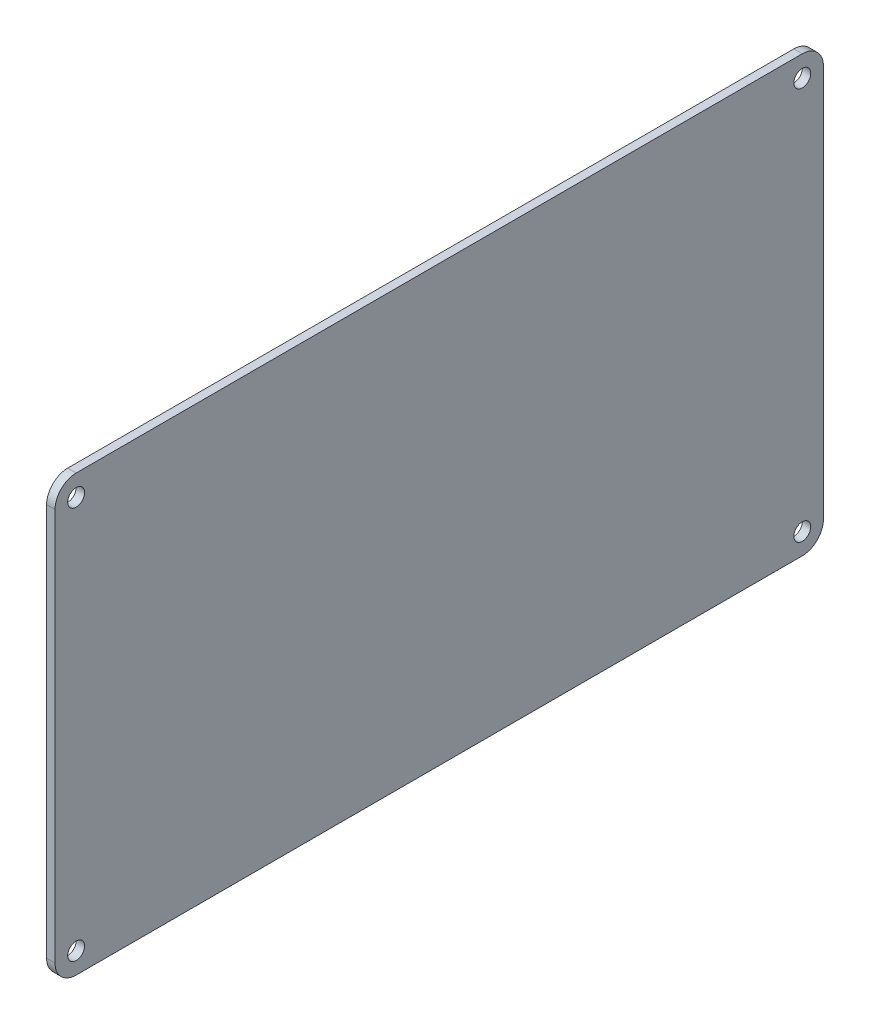
ISO-10303-21;
HEADER;
FILE_DESCRIPTION(('STEP AP214'),'2;1');
FILE_NAME('part.step','',(''),(''),'','','');
FILE_SCHEMA(('AUTOMOTIVE_DESIGN { 1 0 10303 214 1 1 1 1 }'));
ENDSEC;
DATA;
#1=APPLICATION_CONTEXT('core data for automotive mechanical design processes');
#2=APPLICATION_PROTOCOL_DEFINITION('international standard','automotive_design',2000,#1);
#3=PRODUCT_CONTEXT('',#1,'mechanical');
#4=PRODUCT('Part','Part','',(#3));
#5=PRODUCT_RELATED_PRODUCT_CATEGORY('part','',(#4));
#6=PRODUCT_DEFINITION_FORMATION('','',#4);
#7=PRODUCT_DEFINITION_CONTEXT('part definition',#1,'design');
#8=PRODUCT_DEFINITION('design','',#6,#7);
#9=PRODUCT_DEFINITION_SHAPE('','',#8);
#10=(LENGTH_UNIT() NAMED_UNIT(*) SI_UNIT(.MILLI.,.METRE.));
#11=(NAMED_UNIT(*) PLANE_ANGLE_UNIT() SI_UNIT($,.RADIAN.));
#12=(NAMED_UNIT(*) SI_UNIT($,.STERADIAN.) SOLID_ANGLE_UNIT());
#13=UNCERTAINTY_MEASURE_WITH_UNIT(LENGTH_MEASURE(1.E-05),#10,'distance_accuracy_value','');
#14=(GEOMETRIC_REPRESENTATION_CONTEXT(3) GLOBAL_UNCERTAINTY_ASSIGNED_CONTEXT((#13)) GLOBAL_UNIT_ASSIGNED_CONTEXT((#10,
#11,#12)) REPRESENTATION_CONTEXT('',''));
#15=CARTESIAN_POINT('',(0.,0.,0.));
#16=DIRECTION('',(0.,0.,1.));
#17=DIRECTION('',(1.,0.,0.));
#18=AXIS2_PLACEMENT_3D('',#15,#16,#17);
#19=CARTESIAN_POINT('',(0.,-3.82758620689654,5.));
#20=DIRECTION('',(-1.,0.,0.));
#21=DIRECTION('',(0.,0.,1.));
#22=AXIS2_PLACEMENT_3D('',#19,#20,#21);
#23=CYLINDRICAL_SURFACE('',#22,5.);
#24=DIRECTION('',(1.,0.,0.));
#25=VECTOR('',#24,1.);
#26=CARTESIAN_POINT('',(0.,-8.82758620689654,5.));
#27=LINE('',#26,#25);
#28=CARTESIAN_POINT('',(-2.,-8.82758620689654,5.));
#29=VERTEX_POINT('',#28);
#30=CARTESIAN_POINT('',(0.,-8.82758620689654,5.));
#31=VERTEX_POINT('',#30);
#32=EDGE_CURVE('E130',#29,#31,#27,.T.);
#33=ORIENTED_EDGE('',*,*,#32,.F.);
#34=CARTESIAN_POINT('',(-2.,-3.82758620689654,5.));
#35=DIRECTION('',(1.,0.,0.));
#36=DIRECTION('',(0.,0.,-1.));
#37=AXIS2_PLACEMENT_3D('',#34,#35,#36);
#38=CIRCLE('',#37,5.);
#39=CARTESIAN_POINT('',(-2.,-3.82758620689654,0.));
#40=VERTEX_POINT('',#39);
#41=EDGE_CURVE('E53',#40,#29,#38,.F.);
#42=ORIENTED_EDGE('',*,*,#41,.F.);
#43=DIRECTION('',(1.,0.,0.));
#44=VECTOR('',#43,1.);
#45=CARTESIAN_POINT('',(0.,-3.82758620689654,0.));
#46=LINE('',#45,#44);
#47=CARTESIAN_POINT('',(0.,-3.82758620689654,0.));
#48=VERTEX_POINT('',#47);
#49=EDGE_CURVE('E192',#48,#40,#46,.F.);
#50=ORIENTED_EDGE('',*,*,#49,.F.);
#51=CARTESIAN_POINT('',(0.,-3.82758620689654,5.));
#52=DIRECTION('',(-1.,0.,0.));
#53=DIRECTION('',(0.,0.,1.));
#54=AXIS2_PLACEMENT_3D('',#51,#52,#53);
#55=CIRCLE('',#54,5.);
#56=EDGE_CURVE('E11',#31,#48,#55,.F.);
#57=ORIENTED_EDGE('',*,*,#56,.F.);
#58=EDGE_LOOP('',(#33,#42,#50,#57));
#59=FACE_BOUND('',#58,.T.);
#60=ADVANCED_FACE('F45',(#59),#23,.T.);
#61=CARTESIAN_POINT('',(0.,89.1724137931034,5.));
#62=DIRECTION('',(1.,0.,0.));
#63=DIRECTION('',(0.,0.,-1.));
#64=AXIS2_PLACEMENT_3D('',#61,#62,#63);
#65=CYLINDRICAL_SURFACE('',#64,5.);
#66=DIRECTION('',(-1.,0.,0.));
#67=VECTOR('',#66,1.);
#68=CARTESIAN_POINT('',(0.,94.1724137931035,5.));
#69=LINE('',#68,#67);
#70=CARTESIAN_POINT('',(0.,94.1724137931035,5.));
#71=VERTEX_POINT('',#70);
#72=CARTESIAN_POINT('',(-2.,94.1724137931035,5.));
#73=VERTEX_POINT('',#72);
#74=EDGE_CURVE('E176',#71,#73,#69,.T.);
#75=ORIENTED_EDGE('',*,*,#74,.F.);
#76=CARTESIAN_POINT('',(0.,89.1724137931034,5.));
#77=DIRECTION('',(-1.,0.,0.));
#78=DIRECTION('',(0.,0.,1.));
#79=AXIS2_PLACEMENT_3D('',#76,#77,#78);
#80=CIRCLE('',#79,5.);
#81=CARTESIAN_POINT('',(0.,89.1724137931035,0.));
#82=VERTEX_POINT('',#81);
#83=EDGE_CURVE('E184',#82,#71,#80,.F.);
#84=ORIENTED_EDGE('',*,*,#83,.F.);
#85=DIRECTION('',(-1.,0.,0.));
#86=VECTOR('',#85,1.);
#87=CARTESIAN_POINT('',(0.,89.1724137931034,0.));
#88=LINE('',#87,#86);
#89=CARTESIAN_POINT('',(-2.,89.1724137931034,0.));
#90=VERTEX_POINT('',#89);
#91=EDGE_CURVE('E180',#90,#82,#88,.F.);
#92=ORIENTED_EDGE('',*,*,#91,.F.);
#93=CARTESIAN_POINT('',(-2.,89.1724137931034,5.));
#94=DIRECTION('',(1.,0.,0.));
#95=DIRECTION('',(0.,0.,-1.));
#96=AXIS2_PLACEMENT_3D('',#93,#94,#95);
#97=CIRCLE('',#96,5.);
#98=EDGE_CURVE('E187',#73,#90,#97,.F.);
#99=ORIENTED_EDGE('',*,*,#98,.F.);
#100=EDGE_LOOP('',(#75,#84,#92,#99));
#101=FACE_BOUND('',#100,.T.);
#102=ADVANCED_FACE('F264',(#101),#65,.T.);
#103=CARTESIAN_POINT('',(0.,89.1724137931034,177.));
#104=DIRECTION('',(1.,0.,0.));
#105=DIRECTION('',(0.,0.,-1.));
#106=AXIS2_PLACEMENT_3D('',#103,#104,#105);
#107=CYLINDRICAL_SURFACE('',#106,5.);
#108=DIRECTION('',(1.,0.,0.));
#109=VECTOR('',#108,1.);
#110=CARTESIAN_POINT('',(0.,94.1724137931035,177.));
#111=LINE('',#110,#109);
#112=CARTESIAN_POINT('',(-2.,94.1724137931035,177.));
#113=VERTEX_POINT('',#112);
#114=CARTESIAN_POINT('',(0.,94.1724137931035,177.));
#115=VERTEX_POINT('',#114);
#116=EDGE_CURVE('E162',#113,#115,#111,.T.);
#117=ORIENTED_EDGE('',*,*,#116,.F.);
#118=CARTESIAN_POINT('',(-2.,89.1724137931034,177.));
#119=DIRECTION('',(1.,0.,0.));
#120=DIRECTION('',(0.,0.,-1.));
#121=AXIS2_PLACEMENT_3D('',#118,#119,#120);
#122=CIRCLE('',#121,5.);
#123=CARTESIAN_POINT('',(-2.,89.1724137931034,182.));
#124=VERTEX_POINT('',#123);
#125=EDGE_CURVE('E170',#124,#113,#122,.F.);
#126=ORIENTED_EDGE('',*,*,#125,.F.);
#127=DIRECTION('',(1.,0.,0.));
#128=VECTOR('',#127,1.);
#129=CARTESIAN_POINT('',(0.,89.1724137931034,182.));
#130=LINE('',#129,#128);
#131=CARTESIAN_POINT('',(0.,89.1724137931035,182.));
#132=VERTEX_POINT('',#131);
#133=EDGE_CURVE('E166',#132,#124,#130,.F.);
#134=ORIENTED_EDGE('',*,*,#133,.F.);
#135=CARTESIAN_POINT('',(0.,89.1724137931034,177.));
#136=DIRECTION('',(-1.,0.,0.));
#137=DIRECTION('',(0.,0.,1.));
#138=AXIS2_PLACEMENT_3D('',#135,#136,#137);
#139=CIRCLE('',#138,5.);
#140=EDGE_CURVE('E173',#115,#132,#139,.F.);
#141=ORIENTED_EDGE('',*,*,#140,.F.);
#142=EDGE_LOOP('',(#117,#126,#134,#141));
#143=FACE_BOUND('',#142,.T.);
#144=ADVANCED_FACE('F269',(#143),#107,.T.);
#145=CARTESIAN_POINT('',(0.,-3.82758620689654,177.));
#146=DIRECTION('',(-1.,0.,0.));
#147=DIRECTION('',(0.,0.,1.));
#148=AXIS2_PLACEMENT_3D('',#145,#146,#147);
#149=CYLINDRICAL_SURFACE('',#148,5.);
#150=DIRECTION('',(-1.,0.,0.));
#151=VECTOR('',#150,1.);
#152=CARTESIAN_POINT('',(0.,-8.82758620689654,177.));
#153=LINE('',#152,#151);
#154=CARTESIAN_POINT('',(0.,-8.82758620689654,177.));
#155=VERTEX_POINT('',#154);
#156=CARTESIAN_POINT('',(-2.,-8.82758620689654,177.));
#157=VERTEX_POINT('',#156);
#158=EDGE_CURVE('E120',#155,#157,#153,.T.);
#159=ORIENTED_EDGE('',*,*,#158,.F.);
#160=CARTESIAN_POINT('',(0.,-3.82758620689654,177.));
#161=DIRECTION('',(-1.,0.,0.));
#162=DIRECTION('',(0.,0.,1.));
#163=AXIS2_PLACEMENT_3D('',#160,#161,#162);
#164=CIRCLE('',#163,5.);
#165=CARTESIAN_POINT('',(0.,-3.82758620689654,182.));
#166=VERTEX_POINT('',#165);
#167=EDGE_CURVE('E105',#166,#155,#164,.F.);
#168=ORIENTED_EDGE('',*,*,#167,.F.);
#169=DIRECTION('',(-1.,0.,0.));
#170=VECTOR('',#169,1.);
#171=CARTESIAN_POINT('',(0.,-3.82758620689654,182.));
#172=LINE('',#171,#170);
#173=CARTESIAN_POINT('',(-2.,-3.82758620689654,182.));
#174=VERTEX_POINT('',#173);
#175=EDGE_CURVE('E117',#174,#166,#172,.F.);
#176=ORIENTED_EDGE('',*,*,#175,.F.);
#177=CARTESIAN_POINT('',(-2.,-3.82758620689654,177.));
#178=DIRECTION('',(1.,0.,0.));
#179=DIRECTION('',(0.,0.,-1.));
#180=AXIS2_PLACEMENT_3D('',#177,#178,#179);
#181=CIRCLE('',#180,5.);
#182=EDGE_CURVE('E116',#157,#174,#181,.F.);
#183=ORIENTED_EDGE('',*,*,#182,.F.);
#184=EDGE_LOOP('',(#159,#168,#176,#183));
#185=FACE_BOUND('',#184,.T.);
#186=ADVANCED_FACE('F121',(#185),#149,.T.);
#187=CARTESIAN_POINT('',(0.,-8.82758620689654,182.));
#188=DIRECTION('',(0.,1.,0.));
#189=DIRECTION('',(0.,0.,1.));
#190=AXIS2_PLACEMENT_3D('',#187,#188,#189);
#191=PLANE('',#190);
#192=DIRECTION('',(0.,0.,-1.));
#193=VECTOR('',#192,1.);
#194=CARTESIAN_POINT('',(-2.,-8.82758620689654,182.));
#195=LINE('',#194,#193);
#196=EDGE_CURVE('E198',#157,#29,#195,.T.);
#197=ORIENTED_EDGE('',*,*,#196,.T.);
#198=ORIENTED_EDGE('',*,*,#32,.T.);
#199=DIRECTION('',(0.,0.,-1.));
#200=VECTOR('',#199,1.);
#201=CARTESIAN_POINT('',(0.,-8.82758620689654,182.));
#202=LINE('',#201,#200);
#203=EDGE_CURVE('E109',#155,#31,#202,.T.);
#204=ORIENTED_EDGE('',*,*,#203,.F.);
#205=ORIENTED_EDGE('',*,*,#158,.T.);
#206=EDGE_LOOP('',(#197,#198,#204,#205));
#207=FACE_BOUND('',#206,.T.);
#208=ADVANCED_FACE('F129',(#207),#191,.F.);
#209=CARTESIAN_POINT('',(0.,-8.82758620689654,182.));
#210=DIRECTION('',(-1.,0.,0.));
#211=DIRECTION('',(0.,0.,1.));
#212=AXIS2_PLACEMENT_3D('',#209,#210,#211);
#213=PLANE('',#212);
#214=CARTESIAN_POINT('',(0.,-3.82758620689654,5.));
#215=DIRECTION('',(1.,0.,0.));
#216=DIRECTION('',(0.,0.,-1.));
#217=AXIS2_PLACEMENT_3D('',#214,#215,#216);
#218=CIRCLE('',#217,2.);
#219=CARTESIAN_POINT('',(0.,-3.82758620689654,3.));
#220=VERTEX_POINT('',#219);
#221=EDGE_CURVE('E219',#220,#220,#218,.T.);
#222=ORIENTED_EDGE('',*,*,#221,.F.);
#223=EDGE_LOOP('',(#222));
#224=FACE_BOUND('',#223,.T.);
#225=CARTESIAN_POINT('',(0.,89.1724137931034,5.));
#226=DIRECTION('',(1.,0.,0.));
#227=DIRECTION('',(0.,0.,-1.));
#228=AXIS2_PLACEMENT_3D('',#225,#226,#227);
#229=CIRCLE('',#228,2.);
#230=CARTESIAN_POINT('',(0.,89.1724137931034,3.));
#231=VERTEX_POINT('',#230);
#232=EDGE_CURVE('E223',#231,#231,#229,.T.);
#233=ORIENTED_EDGE('',*,*,#232,.F.);
#234=EDGE_LOOP('',(#233));
#235=FACE_BOUND('',#234,.T.);
#236=CARTESIAN_POINT('',(0.,89.1724137931034,177.));
#237=DIRECTION('',(1.,0.,0.));
#238=DIRECTION('',(0.,0.,-1.));
#239=AXIS2_PLACEMENT_3D('',#236,#237,#238);
#240=CIRCLE('',#239,2.);
#241=CARTESIAN_POINT('',(0.,89.1724137931034,175.));
#242=VERTEX_POINT('',#241);
#243=EDGE_CURVE('E218',#242,#242,#240,.T.);
#244=ORIENTED_EDGE('',*,*,#243,.F.);
#245=EDGE_LOOP('',(#244));
#246=FACE_BOUND('',#245,.T.);
#247=CARTESIAN_POINT('',(0.,-3.82758620689654,177.));
#248=DIRECTION('',(1.,0.,0.));
#249=DIRECTION('',(0.,0.,-1.));
#250=AXIS2_PLACEMENT_3D('',#247,#248,#249);
#251=CIRCLE('',#250,2.);
#252=CARTESIAN_POINT('',(0.,-3.82758620689654,175.));
#253=VERTEX_POINT('',#252);
#254=EDGE_CURVE('E145',#253,#253,#251,.T.);
#255=ORIENTED_EDGE('',*,*,#254,.F.);
#256=EDGE_LOOP('',(#255));
#257=FACE_BOUND('',#256,.T.);
#258=ORIENTED_EDGE('',*,*,#203,.T.);
#259=ORIENTED_EDGE('',*,*,#56,.T.);
#260=DIRECTION('',(0.,1.,0.));
#261=VECTOR('',#260,1.);
#262=CARTESIAN_POINT('',(0.,-8.82758620689654,0.));
#263=LINE('',#262,#261);
#264=EDGE_CURVE('E156',#48,#82,#263,.T.);
#265=ORIENTED_EDGE('',*,*,#264,.T.);
#266=ORIENTED_EDGE('',*,*,#83,.T.);
#267=DIRECTION('',(0.,0.,-1.));
#268=VECTOR('',#267,1.);
#269=CARTESIAN_POINT('',(0.,94.1724137931035,182.));
#270=LINE('',#269,#268);
#271=EDGE_CURVE('E132',#115,#71,#270,.T.);
#272=ORIENTED_EDGE('',*,*,#271,.F.);
#273=ORIENTED_EDGE('',*,*,#140,.T.);
#274=DIRECTION('',(0.,1.,0.));
#275=VECTOR('',#274,1.);
#276=CARTESIAN_POINT('',(0.,-8.82758620689654,182.));
#277=LINE('',#276,#275);
#278=EDGE_CURVE('E111',#166,#132,#277,.T.);
#279=ORIENTED_EDGE('',*,*,#278,.F.);
#280=ORIENTED_EDGE('',*,*,#167,.T.);
#281=EDGE_LOOP('',(#258,#259,#265,#266,#272,#273,#279,#280));
#282=FACE_BOUND('',#281,.T.);
#283=ADVANCED_FACE('F107',(#224,#235,#246,#257,#282),#213,.F.);
#284=CARTESIAN_POINT('',(0.,94.1724137931035,182.));
#285=DIRECTION('',(0.,-1.,0.));
#286=DIRECTION('',(0.,0.,-1.));
#287=AXIS2_PLACEMENT_3D('',#284,#285,#286);
#288=PLANE('',#287);
#289=ORIENTED_EDGE('',*,*,#271,.T.);
#290=ORIENTED_EDGE('',*,*,#74,.T.);
#291=DIRECTION('',(0.,0.,-1.));
#292=VECTOR('',#291,1.);
#293=CARTESIAN_POINT('',(-2.,94.1724137931035,182.));
#294=LINE('',#293,#292);
#295=EDGE_CURVE('E136',#113,#73,#294,.T.);
#296=ORIENTED_EDGE('',*,*,#295,.F.);
#297=ORIENTED_EDGE('',*,*,#116,.T.);
#298=EDGE_LOOP('',(#289,#290,#296,#297));
#299=FACE_BOUND('',#298,.T.);
#300=ADVANCED_FACE('F236',(#299),#288,.F.);
#301=CARTESIAN_POINT('',(-2.,-8.82758620689654,182.));
#302=DIRECTION('',(1.,0.,0.));
#303=DIRECTION('',(0.,0.,-1.));
#304=AXIS2_PLACEMENT_3D('',#301,#302,#303);
#305=PLANE('',#304);
#306=CARTESIAN_POINT('',(-2.,-3.82758620689654,5.));
#307=DIRECTION('',(1.,0.,0.));
#308=DIRECTION('',(0.,0.,-1.));
#309=AXIS2_PLACEMENT_3D('',#306,#307,#308);
#310=CIRCLE('',#309,2.);
#311=CARTESIAN_POINT('',(-2.,-3.82758620689654,3.));
#312=VERTEX_POINT('',#311);
#313=EDGE_CURVE('E153',#312,#312,#310,.T.);
#314=ORIENTED_EDGE('',*,*,#313,.T.);
#315=EDGE_LOOP('',(#314));
#316=FACE_BOUND('',#315,.T.);
#317=CARTESIAN_POINT('',(-2.,89.1724137931034,5.));
#318=DIRECTION('',(1.,0.,0.));
#319=DIRECTION('',(0.,0.,-1.));
#320=AXIS2_PLACEMENT_3D('',#317,#318,#319);
#321=CIRCLE('',#320,2.);
#322=CARTESIAN_POINT('',(-2.,89.1724137931034,3.));
#323=VERTEX_POINT('',#322);
#324=EDGE_CURVE('E149',#323,#323,#321,.T.);
#325=ORIENTED_EDGE('',*,*,#324,.T.);
#326=EDGE_LOOP('',(#325));
#327=FACE_BOUND('',#326,.T.);
#328=CARTESIAN_POINT('',(-2.,89.1724137931034,177.));
#329=DIRECTION('',(1.,0.,0.));
#330=DIRECTION('',(0.,0.,-1.));
#331=AXIS2_PLACEMENT_3D('',#328,#329,#330);
#332=CIRCLE('',#331,2.);
#333=CARTESIAN_POINT('',(-2.,89.1724137931034,175.));
#334=VERTEX_POINT('',#333);
#335=EDGE_CURVE('E144',#334,#334,#332,.T.);
#336=ORIENTED_EDGE('',*,*,#335,.T.);
#337=EDGE_LOOP('',(#336));
#338=FACE_BOUND('',#337,.T.);
#339=CARTESIAN_POINT('',(-2.,-3.82758620689654,177.));
#340=DIRECTION('',(1.,0.,0.));
#341=DIRECTION('',(0.,0.,-1.));
#342=AXIS2_PLACEMENT_3D('',#339,#340,#341);
#343=CIRCLE('',#342,2.);
#344=CARTESIAN_POINT('',(-2.,-3.82758620689654,175.));
#345=VERTEX_POINT('',#344);
#346=EDGE_CURVE('E140',#345,#345,#343,.T.);
#347=ORIENTED_EDGE('',*,*,#346,.T.);
#348=EDGE_LOOP('',(#347));
#349=FACE_BOUND('',#348,.T.);
#350=DIRECTION('',(0.,-1.,0.));
#351=VECTOR('',#350,1.);
#352=CARTESIAN_POINT('',(-2.,-8.82758620689654,0.));
#353=LINE('',#352,#351);
#354=EDGE_CURVE('E200',#90,#40,#353,.T.);
#355=ORIENTED_EDGE('',*,*,#354,.T.);
#356=ORIENTED_EDGE('',*,*,#41,.T.);
#357=ORIENTED_EDGE('',*,*,#196,.F.);
#358=ORIENTED_EDGE('',*,*,#182,.T.);
#359=DIRECTION('',(0.,-1.,0.));
#360=VECTOR('',#359,1.);
#361=CARTESIAN_POINT('',(-2.,-8.82758620689654,182.));
#362=LINE('',#361,#360);
#363=EDGE_CURVE('E202',#124,#174,#362,.T.);
#364=ORIENTED_EDGE('',*,*,#363,.F.);
#365=ORIENTED_EDGE('',*,*,#125,.T.);
#366=ORIENTED_EDGE('',*,*,#295,.T.);
#367=ORIENTED_EDGE('',*,*,#98,.T.);
#368=EDGE_LOOP('',(#355,#356,#357,#358,#364,#365,#366,#367));
#369=FACE_BOUND('',#368,.T.);
#370=ADVANCED_FACE('F197',(#316,#327,#338,#349,#369),#305,.F.);
#371=CARTESIAN_POINT('',(0.,0.,182.));
#372=DIRECTION('',(0.,0.,-1.));
#373=DIRECTION('',(-1.,0.,0.));
#374=AXIS2_PLACEMENT_3D('',#371,#372,#373);
#375=PLANE('',#374);
#376=ORIENTED_EDGE('',*,*,#278,.T.);
#377=ORIENTED_EDGE('',*,*,#133,.T.);
#378=ORIENTED_EDGE('',*,*,#363,.T.);
#379=ORIENTED_EDGE('',*,*,#175,.T.);
#380=EDGE_LOOP('',(#376,#377,#378,#379));
#381=FACE_BOUND('',#380,.T.);
#382=ADVANCED_FACE('F249',(#381),#375,.F.);
#383=CARTESIAN_POINT('',(0.,0.,0.));
#384=DIRECTION('',(0.,0.,-1.));
#385=DIRECTION('',(-1.,0.,0.));
#386=AXIS2_PLACEMENT_3D('',#383,#384,#385);
#387=PLANE('',#386);
#388=ORIENTED_EDGE('',*,*,#264,.F.);
#389=ORIENTED_EDGE('',*,*,#49,.T.);
#390=ORIENTED_EDGE('',*,*,#354,.F.);
#391=ORIENTED_EDGE('',*,*,#91,.T.);
#392=EDGE_LOOP('',(#388,#389,#390,#391));
#393=FACE_BOUND('',#392,.T.);
#394=ADVANCED_FACE('F244',(#393),#387,.T.);
#395=CARTESIAN_POINT('',(-168.,-3.82758620689654,177.));
#396=DIRECTION('',(1.,0.,0.));
#397=DIRECTION('',(0.,0.,-1.));
#398=AXIS2_PLACEMENT_3D('',#395,#396,#397);
#399=CYLINDRICAL_SURFACE('',#398,2.);
#400=ORIENTED_EDGE('',*,*,#254,.T.);
#401=EDGE_LOOP('',(#400));
#402=FACE_BOUND('',#401,.T.);
#403=ORIENTED_EDGE('',*,*,#346,.F.);
#404=EDGE_LOOP('',(#403));
#405=FACE_BOUND('',#404,.T.);
#406=ADVANCED_FACE('F241',(#402,#405),#399,.F.);
#407=CARTESIAN_POINT('',(-168.,89.1724137931034,177.));
#408=DIRECTION('',(1.,0.,0.));
#409=DIRECTION('',(0.,0.,-1.));
#410=AXIS2_PLACEMENT_3D('',#407,#408,#409);
#411=CYLINDRICAL_SURFACE('',#410,2.);
#412=ORIENTED_EDGE('',*,*,#243,.T.);
#413=EDGE_LOOP('',(#412));
#414=FACE_BOUND('',#413,.T.);
#415=ORIENTED_EDGE('',*,*,#335,.F.);
#416=EDGE_LOOP('',(#415));
#417=FACE_BOUND('',#416,.T.);
#418=ADVANCED_FACE('F231',(#414,#417),#411,.F.);
#419=CARTESIAN_POINT('',(-168.,89.1724137931034,5.));
#420=DIRECTION('',(1.,0.,0.));
#421=DIRECTION('',(0.,0.,-1.));
#422=AXIS2_PLACEMENT_3D('',#419,#420,#421);
#423=CYLINDRICAL_SURFACE('',#422,2.);
#424=ORIENTED_EDGE('',*,*,#232,.T.);
#425=EDGE_LOOP('',(#424));
#426=FACE_BOUND('',#425,.T.);
#427=ORIENTED_EDGE('',*,*,#324,.F.);
#428=EDGE_LOOP('',(#427));
#429=FACE_BOUND('',#428,.T.);
#430=ADVANCED_FACE('F326',(#426,#429),#423,.F.);
#431=CARTESIAN_POINT('',(-168.,-3.82758620689654,5.));
#432=DIRECTION('',(1.,0.,0.));
#433=DIRECTION('',(0.,0.,-1.));
#434=AXIS2_PLACEMENT_3D('',#431,#432,#433);
#435=CYLINDRICAL_SURFACE('',#434,2.);
#436=ORIENTED_EDGE('',*,*,#221,.T.);
#437=EDGE_LOOP('',(#436));
#438=FACE_BOUND('',#437,.T.);
#439=ORIENTED_EDGE('',*,*,#313,.F.);
#440=EDGE_LOOP('',(#439));
#441=FACE_BOUND('',#440,.T.);
#442=ADVANCED_FACE('F335',(#438,#441),#435,.F.);
#443=CLOSED_SHELL('',(#60,#102,#144,#186,#208,#283,#300,#370,#382,#394,#406,#418,#430,#442));
#444=MANIFOLD_SOLID_BREP('B2',#443);
#445=ADVANCED_BREP_SHAPE_REPRESENTATION('',(#18,#444),#14);
#446=SHAPE_DEFINITION_REPRESENTATION(#9,#445);
ENDSEC;
END-ISO-10303-21;
